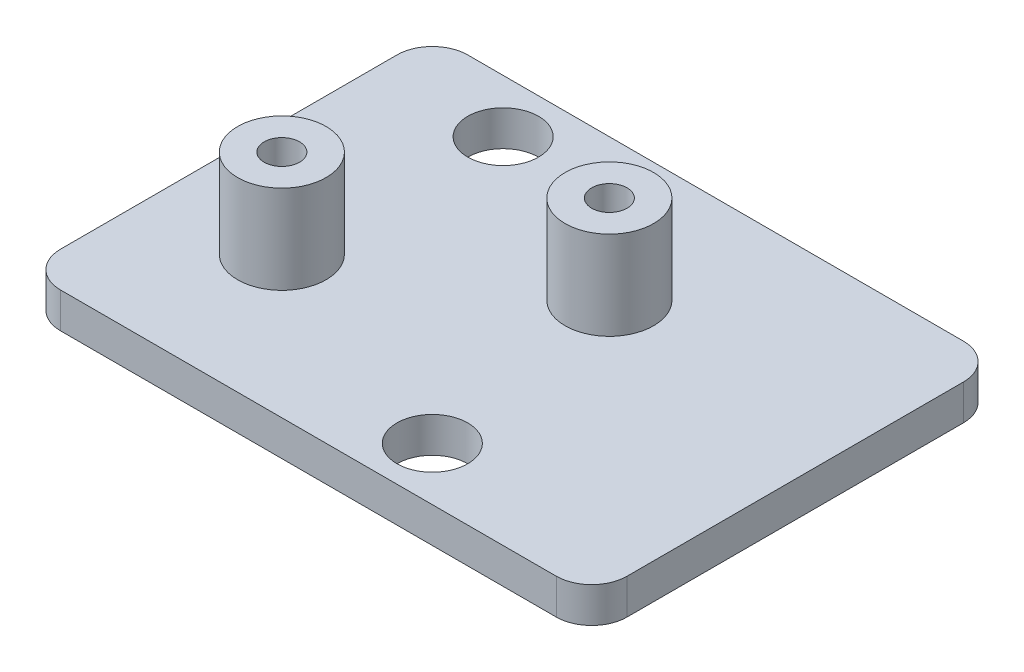
ISO-10303-21;
HEADER;
FILE_DESCRIPTION(('STEP AP214'),'2;1');
FILE_NAME('part.step','',(''),(''),'','','');
FILE_SCHEMA(('AUTOMOTIVE_DESIGN { 1 0 10303 214 1 1 1 1 }'));
ENDSEC;
DATA;
#1=APPLICATION_CONTEXT('core data for automotive mechanical design processes');
#2=APPLICATION_PROTOCOL_DEFINITION('international standard','automotive_design',2000,#1);
#3=PRODUCT_CONTEXT('',#1,'mechanical');
#4=PRODUCT('Part','Part','',(#3));
#5=PRODUCT_RELATED_PRODUCT_CATEGORY('part','',(#4));
#6=PRODUCT_DEFINITION_FORMATION('','',#4);
#7=PRODUCT_DEFINITION_CONTEXT('part definition',#1,'design');
#8=PRODUCT_DEFINITION('design','',#6,#7);
#9=PRODUCT_DEFINITION_SHAPE('','',#8);
#10=(LENGTH_UNIT() NAMED_UNIT(*) SI_UNIT(.MILLI.,.METRE.));
#11=(NAMED_UNIT(*) PLANE_ANGLE_UNIT() SI_UNIT($,.RADIAN.));
#12=(NAMED_UNIT(*) SI_UNIT($,.STERADIAN.) SOLID_ANGLE_UNIT());
#13=UNCERTAINTY_MEASURE_WITH_UNIT(LENGTH_MEASURE(1.E-05),#10,'distance_accuracy_value','');
#14=(GEOMETRIC_REPRESENTATION_CONTEXT(3) GLOBAL_UNCERTAINTY_ASSIGNED_CONTEXT((#13)) GLOBAL_UNIT_ASSIGNED_CONTEXT((#10,
#11,#12)) REPRESENTATION_CONTEXT('',''));
#15=CARTESIAN_POINT('',(0.,0.,0.));
#16=DIRECTION('',(0.,0.,1.));
#17=DIRECTION('',(1.,0.,0.));
#18=AXIS2_PLACEMENT_3D('',#15,#16,#17);
#19=CARTESIAN_POINT('',(30.,1.99999999999991,2.));
#20=DIRECTION('',(0.,-1.,0.));
#21=DIRECTION('',(0.,0.,-1.00000000000001));
#22=AXIS2_PLACEMENT_3D('',#19,#20,#21);
#23=CYLINDRICAL_SURFACE('',#22,2.);
#24=DIRECTION('',(0.,-1.,0.));
#25=VECTOR('',#24,1.);
#26=CARTESIAN_POINT('',(30.,1.99999999999991,0.));
#27=LINE('',#26,#25);
#28=CARTESIAN_POINT('',(30.,1.99999999999991,0.));
#29=VERTEX_POINT('',#28);
#30=CARTESIAN_POINT('',(30.,0.,0.));
#31=VERTEX_POINT('',#30);
#32=EDGE_CURVE('E102',#29,#31,#27,.T.);
#33=ORIENTED_EDGE('',*,*,#32,.F.);
#34=CARTESIAN_POINT('',(30.,1.99999999999991,2.));
#35=DIRECTION('',(0.,1.,0.));
#36=DIRECTION('',(0.,0.,1.00000000000001));
#37=AXIS2_PLACEMENT_3D('',#34,#35,#36);
#38=CIRCLE('',#37,2.);
#39=CARTESIAN_POINT('',(32.,1.9999999999999,2.));
#40=VERTEX_POINT('',#39);
#41=EDGE_CURVE('E41',#40,#29,#38,.T.);
#42=ORIENTED_EDGE('',*,*,#41,.F.);
#43=DIRECTION('',(0.,-1.,0.));
#44=VECTOR('',#43,1.);
#45=CARTESIAN_POINT('',(32.,1.9999999999999,2.));
#46=LINE('',#45,#44);
#47=CARTESIAN_POINT('',(32.,0.,2.));
#48=VERTEX_POINT('',#47);
#49=EDGE_CURVE('E148',#48,#40,#46,.F.);
#50=ORIENTED_EDGE('',*,*,#49,.F.);
#51=CARTESIAN_POINT('',(30.,0.,2.));
#52=DIRECTION('',(0.,1.,0.));
#53=DIRECTION('',(0.,0.,1.00000000000001));
#54=AXIS2_PLACEMENT_3D('',#51,#52,#53);
#55=CIRCLE('',#54,2.);
#56=EDGE_CURVE('E11',#31,#48,#55,.F.);
#57=ORIENTED_EDGE('',*,*,#56,.F.);
#58=EDGE_LOOP('',(#33,#42,#50,#57));
#59=FACE_BOUND('',#58,.T.);
#60=ADVANCED_FACE('F34',(#59),#23,.T.);
#61=CARTESIAN_POINT('',(30.,1.99999999999992,21.0000000000002));
#62=DIRECTION('',(0.,1.,0.));
#63=DIRECTION('',(0.,0.,1.00000000000001));
#64=AXIS2_PLACEMENT_3D('',#61,#62,#63);
#65=CYLINDRICAL_SURFACE('',#64,2.);
#66=DIRECTION('',(0.,1.,0.));
#67=VECTOR('',#66,1.);
#68=CARTESIAN_POINT('',(30.,1.99999999999993,23.0000000000002));
#69=LINE('',#68,#67);
#70=CARTESIAN_POINT('',(30.,0.,23.0000000000002));
#71=VERTEX_POINT('',#70);
#72=CARTESIAN_POINT('',(30.,1.99999999999993,23.0000000000002));
#73=VERTEX_POINT('',#72);
#74=EDGE_CURVE('E137',#71,#73,#69,.T.);
#75=ORIENTED_EDGE('',*,*,#74,.F.);
#76=CARTESIAN_POINT('',(30.,0.,21.0000000000002));
#77=DIRECTION('',(0.,1.,0.));
#78=DIRECTION('',(0.,0.,1.00000000000001));
#79=AXIS2_PLACEMENT_3D('',#76,#77,#78);
#80=CIRCLE('',#79,2.);
#81=CARTESIAN_POINT('',(32.,0.,21.0000000000002));
#82=VERTEX_POINT('',#81);
#83=EDGE_CURVE('E143',#82,#71,#80,.F.);
#84=ORIENTED_EDGE('',*,*,#83,.F.);
#85=DIRECTION('',(0.,1.,0.));
#86=VECTOR('',#85,1.);
#87=CARTESIAN_POINT('',(32.,1.99999999999991,21.0000000000002));
#88=LINE('',#87,#86);
#89=CARTESIAN_POINT('',(32.,1.99999999999991,21.0000000000002));
#90=VERTEX_POINT('',#89);
#91=EDGE_CURVE('E140',#90,#82,#88,.F.);
#92=ORIENTED_EDGE('',*,*,#91,.F.);
#93=CARTESIAN_POINT('',(30.,1.99999999999992,21.0000000000002));
#94=DIRECTION('',(0.,1.,0.));
#95=DIRECTION('',(0.,0.,1.00000000000001));
#96=AXIS2_PLACEMENT_3D('',#93,#94,#95);
#97=CIRCLE('',#96,2.);
#98=EDGE_CURVE('E145',#73,#90,#97,.T.);
#99=ORIENTED_EDGE('',*,*,#98,.F.);
#100=EDGE_LOOP('',(#75,#84,#92,#99));
#101=FACE_BOUND('',#100,.T.);
#102=ADVANCED_FACE('F238',(#101),#65,.T.);
#103=CARTESIAN_POINT('',(2.,2.,21.0000000000002));
#104=DIRECTION('',(0.,1.,0.));
#105=DIRECTION('',(0.,0.,1.00000000000001));
#106=AXIS2_PLACEMENT_3D('',#103,#104,#105);
#107=CYLINDRICAL_SURFACE('',#106,2.);
#108=DIRECTION('',(0.,1.,0.));
#109=VECTOR('',#108,1.);
#110=CARTESIAN_POINT('',(0.,2.00000000000001,21.0000000000002));
#111=LINE('',#110,#109);
#112=CARTESIAN_POINT('',(0.,0.,21.0000000000002));
#113=VERTEX_POINT('',#112);
#114=CARTESIAN_POINT('',(0.,2.00000000000001,21.0000000000002));
#115=VERTEX_POINT('',#114);
#116=EDGE_CURVE('E127',#113,#115,#111,.T.);
#117=ORIENTED_EDGE('',*,*,#116,.F.);
#118=CARTESIAN_POINT('',(2.,0.,21.0000000000002));
#119=DIRECTION('',(0.,1.,0.));
#120=DIRECTION('',(0.,0.,1.00000000000001));
#121=AXIS2_PLACEMENT_3D('',#118,#119,#120);
#122=CIRCLE('',#121,2.);
#123=CARTESIAN_POINT('',(2.,0.,23.0000000000002));
#124=VERTEX_POINT('',#123);
#125=EDGE_CURVE('E133',#124,#113,#122,.F.);
#126=ORIENTED_EDGE('',*,*,#125,.F.);
#127=DIRECTION('',(0.,1.,0.));
#128=VECTOR('',#127,1.);
#129=CARTESIAN_POINT('',(2.,2.,23.0000000000002));
#130=LINE('',#129,#128);
#131=CARTESIAN_POINT('',(2.,2.,23.0000000000002));
#132=VERTEX_POINT('',#131);
#133=EDGE_CURVE('E130',#132,#124,#130,.F.);
#134=ORIENTED_EDGE('',*,*,#133,.F.);
#135=CARTESIAN_POINT('',(2.,2.,21.0000000000002));
#136=DIRECTION('',(0.,1.,0.));
#137=DIRECTION('',(0.,0.,1.00000000000001));
#138=AXIS2_PLACEMENT_3D('',#135,#136,#137);
#139=CIRCLE('',#138,2.);
#140=EDGE_CURVE('E135',#115,#132,#139,.T.);
#141=ORIENTED_EDGE('',*,*,#140,.F.);
#142=EDGE_LOOP('',(#117,#126,#134,#141));
#143=FACE_BOUND('',#142,.T.);
#144=ADVANCED_FACE('F242',(#143),#107,.T.);
#145=CARTESIAN_POINT('',(2.,1.99999999999999,2.));
#146=DIRECTION('',(0.,1.,0.));
#147=DIRECTION('',(0.,0.,1.00000000000001));
#148=AXIS2_PLACEMENT_3D('',#145,#146,#147);
#149=CYLINDRICAL_SURFACE('',#148,2.);
#150=DIRECTION('',(0.,1.,0.));
#151=VECTOR('',#150,1.);
#152=CARTESIAN_POINT('',(2.,1.99999999999999,0.));
#153=LINE('',#152,#151);
#154=CARTESIAN_POINT('',(2.,0.,0.));
#155=VERTEX_POINT('',#154);
#156=CARTESIAN_POINT('',(2.,1.99999999999999,0.));
#157=VERTEX_POINT('',#156);
#158=EDGE_CURVE('E101',#155,#157,#153,.T.);
#159=ORIENTED_EDGE('',*,*,#158,.F.);
#160=CARTESIAN_POINT('',(2.,0.,2.));
#161=DIRECTION('',(0.,1.,0.));
#162=DIRECTION('',(0.,0.,1.00000000000001));
#163=AXIS2_PLACEMENT_3D('',#160,#161,#162);
#164=CIRCLE('',#163,2.);
#165=CARTESIAN_POINT('',(0.,0.,2.));
#166=VERTEX_POINT('',#165);
#167=EDGE_CURVE('E107',#166,#155,#164,.F.);
#168=ORIENTED_EDGE('',*,*,#167,.F.);
#169=DIRECTION('',(0.,1.,0.));
#170=VECTOR('',#169,1.);
#171=CARTESIAN_POINT('',(0.,2.,2.));
#172=LINE('',#171,#170);
#173=CARTESIAN_POINT('',(0.,2.,2.));
#174=VERTEX_POINT('',#173);
#175=EDGE_CURVE('E115',#174,#166,#172,.F.);
#176=ORIENTED_EDGE('',*,*,#175,.F.);
#177=CARTESIAN_POINT('',(2.,1.99999999999999,2.));
#178=DIRECTION('',(0.,1.,0.));
#179=DIRECTION('',(0.,0.,1.00000000000001));
#180=AXIS2_PLACEMENT_3D('',#177,#178,#179);
#181=CIRCLE('',#180,2.);
#182=EDGE_CURVE('E114',#157,#174,#181,.T.);
#183=ORIENTED_EDGE('',*,*,#182,.F.);
#184=EDGE_LOOP('',(#159,#168,#176,#183));
#185=FACE_BOUND('',#184,.T.);
#186=ADVANCED_FACE('F118',(#185),#149,.T.);
#187=CARTESIAN_POINT('',(0.,2.,0.));
#188=DIRECTION('',(1.,0.,0.));
#189=DIRECTION('',(0.,0.,-1.00000000000001));
#190=AXIS2_PLACEMENT_3D('',#187,#188,#189);
#191=PLANE('',#190);
#192=DIRECTION('',(0.,0.,1.00000000000001));
#193=VECTOR('',#192,1.);
#194=CARTESIAN_POINT('',(0.,0.,0.));
#195=LINE('',#194,#193);
#196=EDGE_CURVE('E110',#166,#113,#195,.T.);
#197=ORIENTED_EDGE('',*,*,#196,.T.);
#198=ORIENTED_EDGE('',*,*,#116,.T.);
#199=DIRECTION('',(0.,0.,1.00000000000001));
#200=VECTOR('',#199,1.);
#201=CARTESIAN_POINT('',(0.,2.,0.));
#202=LINE('',#201,#200);
#203=EDGE_CURVE('E103',#174,#115,#202,.T.);
#204=ORIENTED_EDGE('',*,*,#203,.F.);
#205=ORIENTED_EDGE('',*,*,#175,.T.);
#206=EDGE_LOOP('',(#197,#198,#204,#205));
#207=FACE_BOUND('',#206,.T.);
#208=ADVANCED_FACE('F253',(#207),#191,.F.);
#209=CARTESIAN_POINT('',(0.,2.00000000000001,23.0000000000002));
#210=DIRECTION('',(0.,0.,-1.00000000000001));
#211=DIRECTION('',(-1.,0.,0.));
#212=AXIS2_PLACEMENT_3D('',#209,#210,#211);
#213=PLANE('',#212);
#214=DIRECTION('',(1.,0.,0.));
#215=VECTOR('',#214,1.);
#216=CARTESIAN_POINT('',(0.,0.,23.0000000000002));
#217=LINE('',#216,#215);
#218=EDGE_CURVE('E157',#124,#71,#217,.T.);
#219=ORIENTED_EDGE('',*,*,#218,.T.);
#220=ORIENTED_EDGE('',*,*,#74,.T.);
#221=DIRECTION('',(1.,0.,0.));
#222=VECTOR('',#221,1.);
#223=CARTESIAN_POINT('',(0.,2.00000000000001,23.0000000000002));
#224=LINE('',#223,#222);
#225=EDGE_CURVE('E164',#132,#73,#224,.T.);
#226=ORIENTED_EDGE('',*,*,#225,.F.);
#227=ORIENTED_EDGE('',*,*,#133,.T.);
#228=EDGE_LOOP('',(#219,#220,#226,#227));
#229=FACE_BOUND('',#228,.T.);
#230=ADVANCED_FACE('F256',(#229),#213,.F.);
#231=CARTESIAN_POINT('',(32.,1.9999999999999,0.));
#232=DIRECTION('',(-1.,0.,0.));
#233=DIRECTION('',(0.,0.,1.00000000000001));
#234=AXIS2_PLACEMENT_3D('',#231,#232,#233);
#235=PLANE('',#234);
#236=DIRECTION('',(0.,0.,-1.00000000000001));
#237=VECTOR('',#236,1.);
#238=CARTESIAN_POINT('',(32.,0.,0.));
#239=LINE('',#238,#237);
#240=EDGE_CURVE('E104',#82,#48,#239,.T.);
#241=ORIENTED_EDGE('',*,*,#240,.T.);
#242=ORIENTED_EDGE('',*,*,#49,.T.);
#243=DIRECTION('',(0.,0.,-1.00000000000001));
#244=VECTOR('',#243,1.);
#245=CARTESIAN_POINT('',(32.,1.9999999999999,0.));
#246=LINE('',#245,#244);
#247=EDGE_CURVE('E122',#90,#40,#246,.T.);
#248=ORIENTED_EDGE('',*,*,#247,.F.);
#249=ORIENTED_EDGE('',*,*,#91,.T.);
#250=EDGE_LOOP('',(#241,#242,#248,#249));
#251=FACE_BOUND('',#250,.T.);
#252=ADVANCED_FACE('F155',(#251),#235,.F.);
#253=CARTESIAN_POINT('',(0.,2.,0.));
#254=DIRECTION('',(0.,0.,1.00000000000001));
#255=DIRECTION('',(1.,0.,0.));
#256=AXIS2_PLACEMENT_3D('',#253,#254,#255);
#257=PLANE('',#256);
#258=DIRECTION('',(-1.,0.,0.));
#259=VECTOR('',#258,1.);
#260=CARTESIAN_POINT('',(0.,2.,0.));
#261=LINE('',#260,#259);
#262=EDGE_CURVE('E119',#29,#157,#261,.T.);
#263=ORIENTED_EDGE('',*,*,#262,.F.);
#264=ORIENTED_EDGE('',*,*,#32,.T.);
#265=DIRECTION('',(-1.,0.,0.));
#266=VECTOR('',#265,1.);
#267=CARTESIAN_POINT('',(0.,0.,0.));
#268=LINE('',#267,#266);
#269=EDGE_CURVE('E96',#31,#155,#268,.T.);
#270=ORIENTED_EDGE('',*,*,#269,.T.);
#271=ORIENTED_EDGE('',*,*,#158,.T.);
#272=EDGE_LOOP('',(#263,#264,#270,#271));
#273=FACE_BOUND('',#272,.T.);
#274=ADVANCED_FACE('F99',(#273),#257,.F.);
#275=CARTESIAN_POINT('',(0.,2.,0.));
#276=DIRECTION('',(0.,1.,0.));
#277=DIRECTION('',(0.,0.,1.00000000000001));
#278=AXIS2_PLACEMENT_3D('',#275,#276,#277);
#279=PLANE('',#278);
#280=CARTESIAN_POINT('',(7.00000000000001,1.99999999999997,3.));
#281=DIRECTION('',(0.,1.,0.));
#282=DIRECTION('',(0.,0.,1.00000000000001));
#283=AXIS2_PLACEMENT_3D('',#280,#281,#282);
#284=CIRCLE('',#283,2.);
#285=CARTESIAN_POINT('',(7.00000000000001,1.99999999999997,5.00000000000002));
#286=VERTEX_POINT('',#285);
#287=EDGE_CURVE('E199',#286,#286,#284,.T.);
#288=ORIENTED_EDGE('',*,*,#287,.F.);
#289=EDGE_LOOP('',(#288));
#290=FACE_BOUND('',#289,.T.);
#291=CARTESIAN_POINT('',(20.,1.99999999999995,20.0000000000003));
#292=DIRECTION('',(0.,1.,0.));
#293=DIRECTION('',(0.,0.,1.00000000000001));
#294=AXIS2_PLACEMENT_3D('',#291,#292,#293);
#295=CIRCLE('',#294,2.00000000000001);
#296=CARTESIAN_POINT('',(20.,1.99999999999995,22.0000000000003));
#297=VERTEX_POINT('',#296);
#298=EDGE_CURVE('E193',#297,#297,#295,.T.);
#299=ORIENTED_EDGE('',*,*,#298,.F.);
#300=EDGE_LOOP('',(#299));
#301=FACE_BOUND('',#300,.T.);
#302=CARTESIAN_POINT('',(6.49999999999999,2.,15.0000000000001));
#303=DIRECTION('',(0.,1.,0.));
#304=DIRECTION('',(0.,0.,1.00000000000001));
#305=AXIS2_PLACEMENT_3D('',#302,#303,#304);
#306=CIRCLE('',#305,2.5);
#307=CARTESIAN_POINT('',(6.49999999999999,2.,17.5000000000001));
#308=VERTEX_POINT('',#307);
#309=EDGE_CURVE('E175',#308,#308,#306,.T.);
#310=ORIENTED_EDGE('',*,*,#309,.F.);
#311=EDGE_LOOP('',(#310));
#312=FACE_BOUND('',#311,.T.);
#313=CARTESIAN_POINT('',(18.,1.99999999999995,8.00000000000028));
#314=DIRECTION('',(0.,1.,0.));
#315=DIRECTION('',(0.,0.,1.00000000000001));
#316=AXIS2_PLACEMENT_3D('',#313,#314,#315);
#317=CIRCLE('',#316,2.5);
#318=CARTESIAN_POINT('',(18.,1.99999999999995,10.5000000000003));
#319=VERTEX_POINT('',#318);
#320=EDGE_CURVE('E169',#319,#319,#317,.T.);
#321=ORIENTED_EDGE('',*,*,#320,.F.);
#322=EDGE_LOOP('',(#321));
#323=FACE_BOUND('',#322,.T.);
#324=ORIENTED_EDGE('',*,*,#247,.T.);
#325=ORIENTED_EDGE('',*,*,#41,.T.);
#326=ORIENTED_EDGE('',*,*,#262,.T.);
#327=ORIENTED_EDGE('',*,*,#182,.T.);
#328=ORIENTED_EDGE('',*,*,#203,.T.);
#329=ORIENTED_EDGE('',*,*,#140,.T.);
#330=ORIENTED_EDGE('',*,*,#225,.T.);
#331=ORIENTED_EDGE('',*,*,#98,.T.);
#332=EDGE_LOOP('',(#324,#325,#326,#327,#328,#329,#330,#331));
#333=FACE_BOUND('',#332,.T.);
#334=ADVANCED_FACE('F151',(#290,#301,#312,#323,#333),#279,.T.);
#335=CARTESIAN_POINT('',(0.,0.,0.));
#336=DIRECTION('',(0.,1.,0.));
#337=DIRECTION('',(0.,0.,1.00000000000001));
#338=AXIS2_PLACEMENT_3D('',#335,#336,#337);
#339=PLANE('',#338);
#340=CARTESIAN_POINT('',(7.00000000000001,0.,3.));
#341=DIRECTION('',(0.,1.,0.));
#342=DIRECTION('',(0.,0.,1.00000000000001));
#343=AXIS2_PLACEMENT_3D('',#340,#341,#342);
#344=CIRCLE('',#343,2.);
#345=CARTESIAN_POINT('',(7.00000000000001,0.,5.00000000000002));
#346=VERTEX_POINT('',#345);
#347=EDGE_CURVE('E185',#346,#346,#344,.T.);
#348=ORIENTED_EDGE('',*,*,#347,.T.);
#349=EDGE_LOOP('',(#348));
#350=FACE_BOUND('',#349,.T.);
#351=CARTESIAN_POINT('',(20.,0.,20.0000000000003));
#352=DIRECTION('',(0.,1.,0.));
#353=DIRECTION('',(0.,0.,1.00000000000001));
#354=AXIS2_PLACEMENT_3D('',#351,#352,#353);
#355=CIRCLE('',#354,2.00000000000001);
#356=CARTESIAN_POINT('',(20.,0.,22.0000000000003));
#357=VERTEX_POINT('',#356);
#358=EDGE_CURVE('E196',#357,#357,#355,.T.);
#359=ORIENTED_EDGE('',*,*,#358,.T.);
#360=EDGE_LOOP('',(#359));
#361=FACE_BOUND('',#360,.T.);
#362=CARTESIAN_POINT('',(6.49999999999999,0.,15.0000000000001));
#363=DIRECTION('',(0.,1.,0.));
#364=DIRECTION('',(0.,0.,1.00000000000001));
#365=AXIS2_PLACEMENT_3D('',#362,#363,#364);
#366=CIRCLE('',#365,1.);
#367=CARTESIAN_POINT('',(6.49999999999999,0.,16.0000000000001));
#368=VERTEX_POINT('',#367);
#369=EDGE_CURVE('E178',#368,#368,#366,.T.);
#370=ORIENTED_EDGE('',*,*,#369,.T.);
#371=EDGE_LOOP('',(#370));
#372=FACE_BOUND('',#371,.T.);
#373=CARTESIAN_POINT('',(18.,0.,8.00000000000028));
#374=DIRECTION('',(0.,1.,0.));
#375=DIRECTION('',(0.,0.,1.00000000000001));
#376=AXIS2_PLACEMENT_3D('',#373,#374,#375);
#377=CIRCLE('',#376,1.);
#378=CARTESIAN_POINT('',(18.,0.,9.00000000000029));
#379=VERTEX_POINT('',#378);
#380=EDGE_CURVE('E184',#379,#379,#377,.T.);
#381=ORIENTED_EDGE('',*,*,#380,.T.);
#382=EDGE_LOOP('',(#381));
#383=FACE_BOUND('',#382,.T.);
#384=ORIENTED_EDGE('',*,*,#269,.F.);
#385=ORIENTED_EDGE('',*,*,#56,.T.);
#386=ORIENTED_EDGE('',*,*,#240,.F.);
#387=ORIENTED_EDGE('',*,*,#83,.T.);
#388=ORIENTED_EDGE('',*,*,#218,.F.);
#389=ORIENTED_EDGE('',*,*,#125,.T.);
#390=ORIENTED_EDGE('',*,*,#196,.F.);
#391=ORIENTED_EDGE('',*,*,#167,.T.);
#392=EDGE_LOOP('',(#384,#385,#386,#387,#388,#389,#390,#391));
#393=FACE_BOUND('',#392,.T.);
#394=ADVANCED_FACE('F108',(#350,#361,#372,#383,#393),#339,.F.);
#395=CARTESIAN_POINT('',(18.,6.99999999999994,8.00000000000028));
#396=DIRECTION('',(0.,-1.,0.));
#397=DIRECTION('',(0.,0.,-1.00000000000001));
#398=AXIS2_PLACEMENT_3D('',#395,#396,#397);
#399=CYLINDRICAL_SURFACE('',#398,2.5);
#400=CARTESIAN_POINT('',(18.,6.99999999999994,8.00000000000028));
#401=DIRECTION('',(0.,1.,0.));
#402=DIRECTION('',(0.,0.,1.00000000000001));
#403=AXIS2_PLACEMENT_3D('',#400,#401,#402);
#404=CIRCLE('',#403,2.5);
#405=CARTESIAN_POINT('',(18.,6.99999999999994,10.5000000000003));
#406=VERTEX_POINT('',#405);
#407=EDGE_CURVE('E161',#406,#406,#404,.T.);
#408=ORIENTED_EDGE('',*,*,#407,.F.);
#409=EDGE_LOOP('',(#408));
#410=FACE_BOUND('',#409,.T.);
#411=ORIENTED_EDGE('',*,*,#320,.T.);
#412=EDGE_LOOP('',(#411));
#413=FACE_BOUND('',#412,.T.);
#414=ADVANCED_FACE('F223',(#410,#413),#399,.T.);
#415=CARTESIAN_POINT('',(18.,6.99999999999994,8.00000000000028));
#416=DIRECTION('',(0.,1.,0.));
#417=DIRECTION('',(0.,0.,1.00000000000001));
#418=AXIS2_PLACEMENT_3D('',#415,#416,#417);
#419=PLANE('',#418);
#420=CARTESIAN_POINT('',(18.,6.99999999999994,8.00000000000028));
#421=DIRECTION('',(0.,1.,0.));
#422=DIRECTION('',(0.,0.,1.00000000000001));
#423=AXIS2_PLACEMENT_3D('',#420,#421,#422);
#424=CIRCLE('',#423,1.);
#425=CARTESIAN_POINT('',(18.,6.99999999999994,9.00000000000029));
#426=VERTEX_POINT('',#425);
#427=EDGE_CURVE('E181',#426,#426,#424,.T.);
#428=ORIENTED_EDGE('',*,*,#427,.F.);
#429=EDGE_LOOP('',(#428));
#430=FACE_BOUND('',#429,.T.);
#431=ORIENTED_EDGE('',*,*,#407,.T.);
#432=EDGE_LOOP('',(#431));
#433=FACE_BOUND('',#432,.T.);
#434=ADVANCED_FACE('F225',(#430,#433),#419,.T.);
#435=CARTESIAN_POINT('',(6.49999999999999,6.99999999999995,15.0000000000001));
#436=DIRECTION('',(0.,-1.,0.));
#437=DIRECTION('',(0.,0.,-1.00000000000001));
#438=AXIS2_PLACEMENT_3D('',#435,#436,#437);
#439=CYLINDRICAL_SURFACE('',#438,2.5);
#440=CARTESIAN_POINT('',(6.49999999999999,6.99999999999995,15.0000000000001));
#441=DIRECTION('',(0.,1.,0.));
#442=DIRECTION('',(0.,0.,1.00000000000001));
#443=AXIS2_PLACEMENT_3D('',#440,#441,#442);
#444=CIRCLE('',#443,2.5);
#445=CARTESIAN_POINT('',(6.49999999999999,6.99999999999996,17.5000000000001));
#446=VERTEX_POINT('',#445);
#447=EDGE_CURVE('E172',#446,#446,#444,.T.);
#448=ORIENTED_EDGE('',*,*,#447,.F.);
#449=EDGE_LOOP('',(#448));
#450=FACE_BOUND('',#449,.T.);
#451=ORIENTED_EDGE('',*,*,#309,.T.);
#452=EDGE_LOOP('',(#451));
#453=FACE_BOUND('',#452,.T.);
#454=ADVANCED_FACE('F232',(#450,#453),#439,.T.);
#455=CARTESIAN_POINT('',(6.49999999999999,6.99999999999995,15.0000000000001));
#456=DIRECTION('',(0.,1.,0.));
#457=DIRECTION('',(0.,0.,1.00000000000001));
#458=AXIS2_PLACEMENT_3D('',#455,#456,#457);
#459=PLANE('',#458);
#460=CARTESIAN_POINT('',(6.49999999999999,6.99999999999995,15.0000000000001));
#461=DIRECTION('',(0.,1.,0.));
#462=DIRECTION('',(0.,0.,1.00000000000001));
#463=AXIS2_PLACEMENT_3D('',#460,#461,#462);
#464=CIRCLE('',#463,1.);
#465=CARTESIAN_POINT('',(6.49999999999999,6.99999999999996,16.0000000000001));
#466=VERTEX_POINT('',#465);
#467=EDGE_CURVE('E188',#466,#466,#464,.T.);
#468=ORIENTED_EDGE('',*,*,#467,.F.);
#469=EDGE_LOOP('',(#468));
#470=FACE_BOUND('',#469,.T.);
#471=ORIENTED_EDGE('',*,*,#447,.T.);
#472=EDGE_LOOP('',(#471));
#473=FACE_BOUND('',#472,.T.);
#474=ADVANCED_FACE('F295',(#470,#473),#459,.T.);
#475=CARTESIAN_POINT('',(6.49999999999999,0.,15.0000000000001));
#476=DIRECTION('',(0.,1.,0.));
#477=DIRECTION('',(0.,0.,1.00000000000001));
#478=AXIS2_PLACEMENT_3D('',#475,#476,#477);
#479=CYLINDRICAL_SURFACE('',#478,1.);
#480=ORIENTED_EDGE('',*,*,#369,.F.);
#481=EDGE_LOOP('',(#480));
#482=FACE_BOUND('',#481,.T.);
#483=ORIENTED_EDGE('',*,*,#467,.T.);
#484=EDGE_LOOP('',(#483));
#485=FACE_BOUND('',#484,.T.);
#486=ADVANCED_FACE('F305',(#482,#485),#479,.F.);
#487=CARTESIAN_POINT('',(18.,0.,8.00000000000028));
#488=DIRECTION('',(0.,1.,0.));
#489=DIRECTION('',(0.,0.,1.00000000000001));
#490=AXIS2_PLACEMENT_3D('',#487,#488,#489);
#491=CYLINDRICAL_SURFACE('',#490,1.);
#492=ORIENTED_EDGE('',*,*,#380,.F.);
#493=EDGE_LOOP('',(#492));
#494=FACE_BOUND('',#493,.T.);
#495=ORIENTED_EDGE('',*,*,#427,.T.);
#496=EDGE_LOOP('',(#495));
#497=FACE_BOUND('',#496,.T.);
#498=ADVANCED_FACE('F315',(#494,#497),#491,.F.);
#499=CARTESIAN_POINT('',(20.,0.,20.0000000000003));
#500=DIRECTION('',(0.,1.,0.));
#501=DIRECTION('',(0.,0.,1.00000000000001));
#502=AXIS2_PLACEMENT_3D('',#499,#500,#501);
#503=CYLINDRICAL_SURFACE('',#502,2.00000000000001);
#504=ORIENTED_EDGE('',*,*,#358,.F.);
#505=EDGE_LOOP('',(#504));
#506=FACE_BOUND('',#505,.T.);
#507=ORIENTED_EDGE('',*,*,#298,.T.);
#508=EDGE_LOOP('',(#507));
#509=FACE_BOUND('',#508,.T.);
#510=ADVANCED_FACE('F210',(#506,#509),#503,.F.);
#511=CARTESIAN_POINT('',(7.00000000000001,0.,3.));
#512=DIRECTION('',(0.,1.,0.));
#513=DIRECTION('',(0.,0.,1.00000000000001));
#514=AXIS2_PLACEMENT_3D('',#511,#512,#513);
#515=CYLINDRICAL_SURFACE('',#514,2.);
#516=ORIENTED_EDGE('',*,*,#347,.F.);
#517=EDGE_LOOP('',(#516));
#518=FACE_BOUND('',#517,.T.);
#519=ORIENTED_EDGE('',*,*,#287,.T.);
#520=EDGE_LOOP('',(#519));
#521=FACE_BOUND('',#520,.T.);
#522=ADVANCED_FACE('F207',(#518,#521),#515,.F.);
#523=CLOSED_SHELL('',(#60,#102,#144,#186,#208,#230,#252,#274,#334,#394,#414,#434,#454,#474,#486,
#498,#510,#522));
#524=MANIFOLD_SOLID_BREP('B2',#523);
#525=ADVANCED_BREP_SHAPE_REPRESENTATION('',(#18,#524),#14);
#526=SHAPE_DEFINITION_REPRESENTATION(#9,#525);
ENDSEC;
END-ISO-10303-21;
